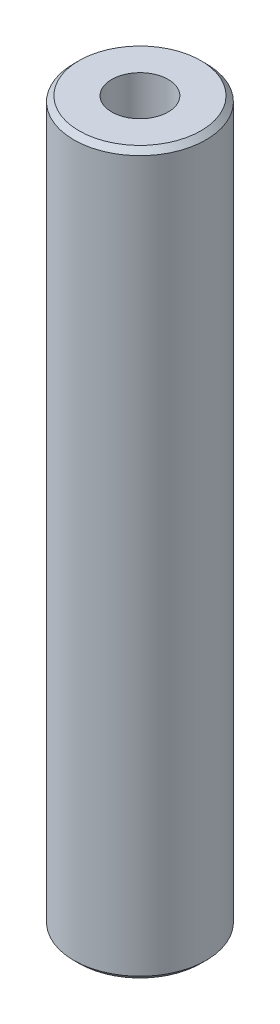
ISO-10303-21;
HEADER;
FILE_DESCRIPTION(('STEP AP214'),'2;1');
FILE_NAME('part.step','',(''),(''),'','','');
FILE_SCHEMA(('AUTOMOTIVE_DESIGN { 1 0 10303 214 1 1 1 1 }'));
ENDSEC;
DATA;
#1=APPLICATION_CONTEXT('core data for automotive mechanical design processes');
#2=APPLICATION_PROTOCOL_DEFINITION('international standard','automotive_design',2000,#1);
#3=PRODUCT_CONTEXT('',#1,'mechanical');
#4=PRODUCT('Part','Part','',(#3));
#5=PRODUCT_RELATED_PRODUCT_CATEGORY('part','',(#4));
#6=PRODUCT_DEFINITION_FORMATION('','',#4);
#7=PRODUCT_DEFINITION_CONTEXT('part definition',#1,'design');
#8=PRODUCT_DEFINITION('design','',#6,#7);
#9=PRODUCT_DEFINITION_SHAPE('','',#8);
#10=(LENGTH_UNIT() NAMED_UNIT(*) SI_UNIT(.MILLI.,.METRE.));
#11=(NAMED_UNIT(*) PLANE_ANGLE_UNIT() SI_UNIT($,.RADIAN.));
#12=(NAMED_UNIT(*) SI_UNIT($,.STERADIAN.) SOLID_ANGLE_UNIT());
#13=UNCERTAINTY_MEASURE_WITH_UNIT(LENGTH_MEASURE(1.E-05),#10,'distance_accuracy_value','');
#14=(GEOMETRIC_REPRESENTATION_CONTEXT(3) GLOBAL_UNCERTAINTY_ASSIGNED_CONTEXT((#13)) GLOBAL_UNIT_ASSIGNED_CONTEXT((#10,
#11,#12)) REPRESENTATION_CONTEXT('',''));
#15=CARTESIAN_POINT('',(0.,0.,0.));
#16=DIRECTION('',(0.,0.,1.));
#17=DIRECTION('',(1.,0.,0.));
#18=AXIS2_PLACEMENT_3D('',#15,#16,#17);
#19=CARTESIAN_POINT('',(0.,600.,0.));
#20=DIRECTION('',(0.,-1.,0.));
#21=DIRECTION('',(0.,0.,-1.));
#22=AXIS2_PLACEMENT_3D('',#19,#20,#21);
#23=CYLINDRICAL_SURFACE('',#22,55.);
#24=CARTESIAN_POINT('',(0.,595.661439796856,0.));
#25=DIRECTION('',(0.,1.,0.));
#26=DIRECTION('',(0.,0.,1.));
#27=AXIS2_PLACEMENT_3D('',#24,#25,#26);
#28=CIRCLE('',#27,55.);
#29=CARTESIAN_POINT('',(0.,595.661439796856,55.));
#30=VERTEX_POINT('',#29);
#31=EDGE_CURVE('E50',#30,#30,#28,.F.);
#32=ORIENTED_EDGE('',*,*,#31,.T.);
#33=EDGE_LOOP('',(#32));
#34=FACE_BOUND('',#33,.T.);
#35=CARTESIAN_POINT('',(0.,4.33856020314405,0.));
#36=DIRECTION('',(0.,1.,0.));
#37=DIRECTION('',(0.,0.,1.));
#38=AXIS2_PLACEMENT_3D('',#35,#36,#37);
#39=CIRCLE('',#38,55.);
#40=CARTESIAN_POINT('',(0.,4.33856020314405,55.));
#41=VERTEX_POINT('',#40);
#42=EDGE_CURVE('E51',#41,#41,#39,.T.);
#43=ORIENTED_EDGE('',*,*,#42,.T.);
#44=EDGE_LOOP('',(#43));
#45=FACE_BOUND('',#44,.T.);
#46=ADVANCED_FACE('F39',(#34,#45),#23,.T.);
#47=CARTESIAN_POINT('',(0.,600.,0.));
#48=DIRECTION('',(0.,1.,0.));
#49=DIRECTION('',(0.,0.,1.));
#50=AXIS2_PLACEMENT_3D('',#47,#48,#49);
#51=PLANE('',#50);
#52=CARTESIAN_POINT('',(0.,600.,0.));
#53=DIRECTION('',(0.,1.,0.));
#54=DIRECTION('',(0.,0.,1.));
#55=AXIS2_PLACEMENT_3D('',#52,#53,#54);
#56=CIRCLE('',#55,50.6614397968558);
#57=CARTESIAN_POINT('',(0.,600.,50.6614397968558));
#58=VERTEX_POINT('',#57);
#59=EDGE_CURVE('E54',#58,#58,#56,.T.);
#60=ORIENTED_EDGE('',*,*,#59,.T.);
#61=EDGE_LOOP('',(#60));
#62=FACE_BOUND('',#61,.T.);
#63=CARTESIAN_POINT('',(0.,600.,0.));
#64=DIRECTION('',(0.,1.,0.));
#65=DIRECTION('',(0.,0.,1.));
#66=AXIS2_PLACEMENT_3D('',#63,#64,#65);
#67=CIRCLE('',#66,23.5080184693053);
#68=CARTESIAN_POINT('',(0.,600.,23.5080184693053));
#69=VERTEX_POINT('',#68);
#70=EDGE_CURVE('E58',#69,#69,#67,.T.);
#71=ORIENTED_EDGE('',*,*,#70,.F.);
#72=EDGE_LOOP('',(#71));
#73=FACE_BOUND('',#72,.T.);
#74=ADVANCED_FACE('F69',(#62,#73),#51,.T.);
#75=CARTESIAN_POINT('',(0.,0.,0.));
#76=DIRECTION('',(0.,1.,0.));
#77=DIRECTION('',(0.,0.,1.));
#78=AXIS2_PLACEMENT_3D('',#75,#76,#77);
#79=PLANE('',#78);
#80=CARTESIAN_POINT('',(0.,0.,0.));
#81=DIRECTION('',(0.,1.,0.));
#82=DIRECTION('',(0.,0.,1.));
#83=AXIS2_PLACEMENT_3D('',#80,#81,#82);
#84=CIRCLE('',#83,50.6614397968558);
#85=CARTESIAN_POINT('',(0.,0.,50.6614397968558));
#86=VERTEX_POINT('',#85);
#87=EDGE_CURVE('E10',#86,#86,#84,.F.);
#88=ORIENTED_EDGE('',*,*,#87,.T.);
#89=EDGE_LOOP('',(#88));
#90=FACE_BOUND('',#89,.T.);
#91=CARTESIAN_POINT('',(0.,0.,0.));
#92=DIRECTION('',(0.,1.,0.));
#93=DIRECTION('',(0.,0.,1.));
#94=AXIS2_PLACEMENT_3D('',#91,#92,#93);
#95=CIRCLE('',#94,23.5080184693053);
#96=CARTESIAN_POINT('',(0.,0.,23.5080184693053));
#97=VERTEX_POINT('',#96);
#98=EDGE_CURVE('E63',#97,#97,#95,.T.);
#99=ORIENTED_EDGE('',*,*,#98,.T.);
#100=EDGE_LOOP('',(#99));
#101=FACE_BOUND('',#100,.T.);
#102=ADVANCED_FACE('F75',(#90,#101),#79,.F.);
#103=CARTESIAN_POINT('',(0.,600.,0.));
#104=DIRECTION('',(0.,-1.,0.));
#105=DIRECTION('',(0.,0.,-1.));
#106=AXIS2_PLACEMENT_3D('',#103,#104,#105);
#107=CYLINDRICAL_SURFACE('',#106,23.5080184693053);
#108=ORIENTED_EDGE('',*,*,#70,.T.);
#109=EDGE_LOOP('',(#108));
#110=FACE_BOUND('',#109,.T.);
#111=ORIENTED_EDGE('',*,*,#98,.F.);
#112=EDGE_LOOP('',(#111));
#113=FACE_BOUND('',#112,.T.);
#114=ADVANCED_FACE('F70',(#110,#113),#107,.F.);
#115=CARTESIAN_POINT('',(0.,600.,0.));
#116=DIRECTION('',(0.,-1.,0.));
#117=DIRECTION('',(0.,0.,-1.));
#118=AXIS2_PLACEMENT_3D('',#115,#116,#117);
#119=CONICAL_SURFACE('',#118,50.6614397968558,0.785398163397443);
#120=ORIENTED_EDGE('',*,*,#31,.F.);
#121=EDGE_LOOP('',(#120));
#122=FACE_BOUND('',#121,.T.);
#123=ORIENTED_EDGE('',*,*,#59,.F.);
#124=EDGE_LOOP('',(#123));
#125=FACE_BOUND('',#124,.T.);
#126=ADVANCED_FACE('F81',(#122,#125),#119,.T.);
#127=CARTESIAN_POINT('',(0.,4.33856020314405,0.));
#128=DIRECTION('',(0.,1.,0.));
#129=DIRECTION('',(0.,0.,1.));
#130=AXIS2_PLACEMENT_3D('',#127,#128,#129);
#131=CONICAL_SURFACE('',#130,55.,0.785398163397462);
#132=ORIENTED_EDGE('',*,*,#87,.F.);
#133=EDGE_LOOP('',(#132));
#134=FACE_BOUND('',#133,.T.);
#135=ORIENTED_EDGE('',*,*,#42,.F.);
#136=EDGE_LOOP('',(#135));
#137=FACE_BOUND('',#136,.T.);
#138=ADVANCED_FACE('F45',(#134,#137),#131,.T.);
#139=CLOSED_SHELL('',(#46,#74,#102,#114,#126,#138));
#140=MANIFOLD_SOLID_BREP('B2',#139);
#141=ADVANCED_BREP_SHAPE_REPRESENTATION('',(#18,#140),#14);
#142=SHAPE_DEFINITION_REPRESENTATION(#9,#141);
ENDSEC;
END-ISO-10303-21;
